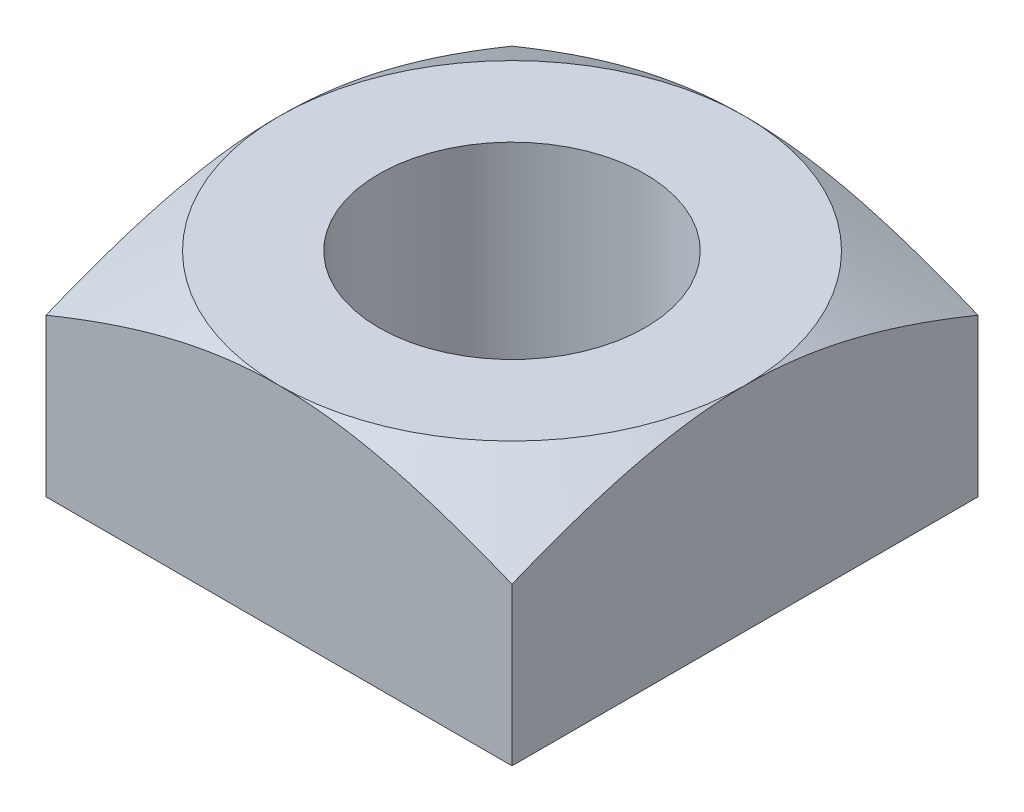
ISO-10303-21;
HEADER;
FILE_DESCRIPTION(('STEP AP214'),'2;1');
FILE_NAME('part.step','',(''),(''),'','','');
FILE_SCHEMA(('AUTOMOTIVE_DESIGN { 1 0 10303 214 1 1 1 1 }'));
ENDSEC;
DATA;
#1=APPLICATION_CONTEXT('core data for automotive mechanical design processes');
#2=APPLICATION_PROTOCOL_DEFINITION('international standard','automotive_design',2000,#1);
#3=PRODUCT_CONTEXT('',#1,'mechanical');
#4=PRODUCT('Part','Part','',(#3));
#5=PRODUCT_RELATED_PRODUCT_CATEGORY('part','',(#4));
#6=PRODUCT_DEFINITION_FORMATION('','',#4);
#7=PRODUCT_DEFINITION_CONTEXT('part definition',#1,'design');
#8=PRODUCT_DEFINITION('design','',#6,#7);
#9=PRODUCT_DEFINITION_SHAPE('','',#8);
#10=(LENGTH_UNIT() NAMED_UNIT(*) SI_UNIT(.MILLI.,.METRE.));
#11=(NAMED_UNIT(*) PLANE_ANGLE_UNIT() SI_UNIT($,.RADIAN.));
#12=(NAMED_UNIT(*) SI_UNIT($,.STERADIAN.) SOLID_ANGLE_UNIT());
#13=UNCERTAINTY_MEASURE_WITH_UNIT(LENGTH_MEASURE(1.E-05),#10,'distance_accuracy_value','');
#14=(GEOMETRIC_REPRESENTATION_CONTEXT(3) GLOBAL_UNCERTAINTY_ASSIGNED_CONTEXT((#13)) GLOBAL_UNIT_ASSIGNED_CONTEXT((#10,
#11,#12)) REPRESENTATION_CONTEXT('',''));
#15=CARTESIAN_POINT('',(0.,0.,0.));
#16=DIRECTION('',(0.,0.,1.));
#17=DIRECTION('',(1.,0.,0.));
#18=AXIS2_PLACEMENT_3D('',#15,#16,#17);
#19=CARTESIAN_POINT('',(-3.5,1.6,3.5));
#20=DIRECTION('',(0.,1.,0.));
#21=DIRECTION('',(0.,0.,1.));
#22=AXIS2_PLACEMENT_3D('',#19,#20,#21);
#23=PLANE('',#22);
#24=CARTESIAN_POINT('',(0.,1.6,0.));
#25=DIRECTION('',(0.,1.,0.));
#26=DIRECTION('',(0.,0.,1.));
#27=AXIS2_PLACEMENT_3D('',#24,#25,#26);
#28=CIRCLE('',#27,2.);
#29=CARTESIAN_POINT('',(0.,1.6,2.));
#30=VERTEX_POINT('',#29);
#31=EDGE_CURVE('E173',#30,#30,#28,.T.);
#32=ORIENTED_EDGE('',*,*,#31,.F.);
#33=EDGE_LOOP('',(#32));
#34=FACE_BOUND('',#33,.T.);
#35=CARTESIAN_POINT('',(0.,1.6,0.));
#36=DIRECTION('',(0.,1.,0.));
#37=DIRECTION('',(0.,0.,1.));
#38=AXIS2_PLACEMENT_3D('',#35,#36,#37);
#39=CIRCLE('',#38,3.5);
#40=CARTESIAN_POINT('',(-3.5,1.6,0.));
#41=VERTEX_POINT('',#40);
#42=CARTESIAN_POINT('',(0.,1.6,3.5));
#43=VERTEX_POINT('',#42);
#44=EDGE_CURVE('E93',#41,#43,#39,.T.);
#45=ORIENTED_EDGE('',*,*,#44,.T.);
#46=CARTESIAN_POINT('',(3.5,1.6,0.));
#47=VERTEX_POINT('',#46);
#48=EDGE_CURVE('E106',#43,#47,#39,.T.);
#49=ORIENTED_EDGE('',*,*,#48,.T.);
#50=CARTESIAN_POINT('',(0.,1.6,-3.5));
#51=VERTEX_POINT('',#50);
#52=EDGE_CURVE('E57',#47,#51,#39,.T.);
#53=ORIENTED_EDGE('',*,*,#52,.T.);
#54=EDGE_CURVE('E104',#51,#41,#39,.T.);
#55=ORIENTED_EDGE('',*,*,#54,.T.);
#56=EDGE_LOOP('',(#45,#49,#53,#55));
#57=FACE_BOUND('',#56,.T.);
#58=ADVANCED_FACE('F36',(#34,#57),#23,.T.);
#59=CARTESIAN_POINT('',(-3.5,1.6,-3.5));
#60=DIRECTION('',(1.,0.,0.));
#61=DIRECTION('',(0.,0.,-1.));
#62=AXIS2_PLACEMENT_3D('',#59,#60,#61);
#63=PLANE('',#62);
#64=CARTESIAN_POINT('',(-3.5,-0.906703040803493,-7.01732424699288));
#65=CARTESIAN_POINT('',(-3.5,-0.8183647613352,-6.84631622698577));
#66=CARTESIAN_POINT('',(-3.5,-0.730512916491286,-6.67505450470276));
#67=CARTESIAN_POINT('',(-3.5,-0.556041209022,-6.33189208262874));
#68=CARTESIAN_POINT('',(-3.5,-0.469421420892597,-6.15999134498584));
#69=CARTESIAN_POINT('',(-3.5,-0.297491875948904,-5.81505515095732));
#70=CARTESIAN_POINT('',(-3.5,-0.212185476740889,-5.64201801780608));
#71=CARTESIAN_POINT('',(-3.5,-0.0434526774197161,-5.29503264202384));
#72=CARTESIAN_POINT('',(-3.5,0.0399737639335897,-5.12108441948256));
#73=CARTESIAN_POINT('',(-3.5,0.209109294297862,-4.76221964059083));
#74=CARTESIAN_POINT('',(-3.5,0.294681338710658,-4.57723829022077));
#75=CARTESIAN_POINT('',(-3.5,0.462413702504157,-4.20573677559367));
#76=CARTESIAN_POINT('',(-3.5,0.544574143537961,-4.01921666649143));
#77=CARTESIAN_POINT('',(-3.5,0.704353209391373,-3.6444019804712));
#78=CARTESIAN_POINT('',(-3.5,0.781975327641687,-3.45610890149154));
#79=CARTESIAN_POINT('',(-3.5,0.931248658766028,-3.07718361251794));
#80=CARTESIAN_POINT('',(-3.5,1.00290078965972,-2.88655176735324));
#81=CARTESIAN_POINT('',(-3.5,1.13741463708561,-2.50462457800413));
#82=CARTESIAN_POINT('',(-3.5,1.20036741820168,-2.31336168839638));
#83=CARTESIAN_POINT('',(-3.5,1.31576373216677,-1.92762500361383));
#84=CARTESIAN_POINT('',(-3.5,1.36820690414002,-1.73315109842823));
#85=CARTESIAN_POINT('',(-3.5,1.45835420754646,-1.34480210612033));
#86=CARTESIAN_POINT('',(-3.5,1.4963295265121,-1.15099135591937));
#87=CARTESIAN_POINT('',(-3.5,1.55565623137818,-0.760782521838996));
#88=CARTESIAN_POINT('',(-3.5,1.5770118037869,-0.564385102225106));
#89=CARTESIAN_POINT('',(-3.5,1.59616502031207,-0.246948294962581));
#90=CARTESIAN_POINT('',(-3.5,1.59988919375486,-0.126247552739355));
#91=CARTESIAN_POINT('',(-3.5,1.60010574764745,0.115172230874657));
#92=CARTESIAN_POINT('',(-3.5,1.59659786152241,0.235891272775966));
#93=CARTESIAN_POINT('',(-3.5,1.58250174471944,0.476932765619612));
#94=CARTESIAN_POINT('',(-3.5,1.57191204418685,0.597255129018975));
#95=CARTESIAN_POINT('',(-3.5,1.54411252847875,0.837126797765718));
#96=CARTESIAN_POINT('',(-3.5,1.52690249772473,0.956676077810189));
#97=CARTESIAN_POINT('',(-3.5,1.4859550758422,1.19809541561606));
#98=CARTESIAN_POINT('',(-3.5,1.46204797257351,1.3199363827827));
#99=CARTESIAN_POINT('',(-3.5,1.40874870685464,1.56240307690696));
#100=CARTESIAN_POINT('',(-3.5,1.37935640476038,1.68302877284338));
#101=CARTESIAN_POINT('',(-3.5,1.31588360975929,1.92309478374023));
#102=CARTESIAN_POINT('',(-3.5,1.28180079124911,2.04253447897701));
#103=CARTESIAN_POINT('',(-3.5,1.20970137526423,2.2802038857662));
#104=CARTESIAN_POINT('',(-3.5,1.17168500010788,2.39843366528653));
#105=CARTESIAN_POINT('',(-3.5,1.05974894784066,2.73061150646999));
#106=CARTESIAN_POINT('',(-3.5,0.982024797617597,2.94327620117727));
#107=CARTESIAN_POINT('',(-3.5,0.818776624992246,3.36560898737656));
#108=CARTESIAN_POINT('',(-3.5,0.733250380874508,3.57527620552667));
#109=CARTESIAN_POINT('',(-3.5,0.556459358947118,3.99239871148477));
#110=CARTESIAN_POINT('',(-3.5,0.465189204028289,4.19985170747513));
#111=CARTESIAN_POINT('',(-3.5,0.278481793345864,4.6128362689507));
#112=CARTESIAN_POINT('',(-3.5,0.183044984761985,4.81836803776815));
#113=CARTESIAN_POINT('',(-3.5,-0.0112837723064443,5.22860059169862));
#114=CARTESIAN_POINT('',(-3.5,-0.11018589341064,5.43329654220325));
#115=CARTESIAN_POINT('',(-3.5,-0.310413456505948,5.84150222975475));
#116=CARTESIAN_POINT('',(-3.5,-0.411738951386549,6.04501194079146));
#117=CARTESIAN_POINT('',(-3.5,-0.616220948591182,6.45096796445593));
#118=CARTESIAN_POINT('',(-3.5,-0.719376417416901,6.65341479857179));
#119=CARTESIAN_POINT('',(-3.5,-0.927183676805307,7.057539609941));
#120=CARTESIAN_POINT('',(-3.5,-1.03183547737091,7.2592175820431));
#121=CARTESIAN_POINT('',(-3.5,-1.31919125754835,7.80899150831728));
#122=CARTESIAN_POINT('',(-3.5,-1.50308711571562,8.15646419743335));
#123=CARTESIAN_POINT('',(-3.5,-1.87342802987369,8.85011310423198));
#124=CARTESIAN_POINT('',(-3.5,-2.05987347217184,9.19628911509126));
#125=CARTESIAN_POINT('',(-3.5,-2.43336035598484,9.88533938025288));
#126=CARTESIAN_POINT('',(-3.5,-2.62038956534621,10.2282202724269));
#127=CARTESIAN_POINT('',(-3.5,-2.99581238655851,10.913155904429));
#128=CARTESIAN_POINT('',(-3.5,-3.18420575157043,11.2552107794879));
#129=CARTESIAN_POINT('',(-3.5,-3.37308705948272,11.5969936149847));
#130=B_SPLINE_CURVE_WITH_KNOTS('',3,(#64,#65,#66,#67,#68,#69,#70,#71,#72,#73,#74,#75,#76,#77,
#78,#79,#80,#81,#82,#83,#84,#85,#86,#87,#88,#89,#90,#91,#92,#93,#94,#95,#96,#97,#98,#99,#100,
#101,#102,#103,#104,#105,#106,#107,#108,#109,#110,#111,#112,#113,#114,#115,#116,#117,#118,#119,
#120,#121,#122,#123,#124,#125,#126,#127,#128,#129),.UNSPECIFIED.,.F.,.F.,(4,2,2,2,2,2,2,2,2,2,2,
2,2,2,2,2,2,2,2,2,2,2,2,2,2,2,2,2,2,2,2,2,4),(0.,0.577433421454476,1.15490161009769,
1.73365941964551,2.31240452074995,2.92382409304863,3.53522184420736,4.14614259423502,
4.75696922742461,5.3608182851893,5.96468807418869,6.5566053258911,7.1483734255422,
7.5104502116292,7.87254034416108,8.2347056530655,8.59688275619545,8.96922938441387,
9.34158549325482,9.714126889476,10.0866472417402,10.7656729214464,11.4448925669334,
12.1247577987082,12.8045502434981,13.4865403819187,14.1685454181999,14.850176828877,
15.5318127983628,16.7112004582328,17.8907688411403,19.0624840189079,20.2339922287411),.UNSPECIFIED.);
#131=CARTESIAN_POINT('',(-3.5,0.762987908916654,-3.5));
#132=VERTEX_POINT('',#131);
#133=EDGE_CURVE('E109',#132,#41,#130,.T.);
#134=ORIENTED_EDGE('',*,*,#133,.F.);
#135=DIRECTION('',(0.,-1.,0.));
#136=VECTOR('',#135,1.);
#137=CARTESIAN_POINT('',(-3.5,1.6,-3.5));
#138=LINE('',#137,#136);
#139=CARTESIAN_POINT('',(-3.5,-1.6,-3.5));
#140=VERTEX_POINT('',#139);
#141=EDGE_CURVE('E188',#132,#140,#138,.T.);
#142=ORIENTED_EDGE('',*,*,#141,.T.);
#143=DIRECTION('',(0.,0.,1.));
#144=VECTOR('',#143,1.);
#145=CARTESIAN_POINT('',(-3.5,-1.6,-3.5));
#146=LINE('',#145,#144);
#147=CARTESIAN_POINT('',(-3.5,-1.6,3.5));
#148=VERTEX_POINT('',#147);
#149=EDGE_CURVE('E169',#140,#148,#146,.T.);
#150=ORIENTED_EDGE('',*,*,#149,.T.);
#151=DIRECTION('',(0.,-1.,0.));
#152=VECTOR('',#151,1.);
#153=CARTESIAN_POINT('',(-3.5,1.6,3.5));
#154=LINE('',#153,#152);
#155=CARTESIAN_POINT('',(-3.5,0.762987908916654,3.5));
#156=VERTEX_POINT('',#155);
#157=EDGE_CURVE('E118',#156,#148,#154,.T.);
#158=ORIENTED_EDGE('',*,*,#157,.F.);
#159=EDGE_CURVE('E97',#41,#156,#130,.T.);
#160=ORIENTED_EDGE('',*,*,#159,.F.);
#161=EDGE_LOOP('',(#134,#142,#150,#158,#160));
#162=FACE_BOUND('',#161,.T.);
#163=ADVANCED_FACE('F38',(#162),#63,.F.);
#164=CARTESIAN_POINT('',(-3.5,1.6,3.5));
#165=DIRECTION('',(0.,0.,-1.));
#166=DIRECTION('',(-1.,0.,0.));
#167=AXIS2_PLACEMENT_3D('',#164,#165,#166);
#168=PLANE('',#167);
#169=CARTESIAN_POINT('',(-7.01732424699288,-0.906703040803492,3.5));
#170=CARTESIAN_POINT('',(-6.84631622698576,-0.818364761335199,3.5));
#171=CARTESIAN_POINT('',(-6.67505450470276,-0.730512916491285,3.5));
#172=CARTESIAN_POINT('',(-6.33189208262874,-0.556041209021999,3.5));
#173=CARTESIAN_POINT('',(-6.15999134498584,-0.469421420892595,3.5));
#174=CARTESIAN_POINT('',(-5.81505515095732,-0.297491875948902,3.5));
#175=CARTESIAN_POINT('',(-5.64201801780608,-0.212185476740888,3.5));
#176=CARTESIAN_POINT('',(-5.29503264202384,-0.0434526774197151,3.5));
#177=CARTESIAN_POINT('',(-5.12108441948255,0.039973763933591,3.5));
#178=CARTESIAN_POINT('',(-4.76221964059082,0.209109294297863,3.5));
#179=CARTESIAN_POINT('',(-4.57723829022077,0.294681338710659,3.5));
#180=CARTESIAN_POINT('',(-4.20573677559367,0.462413702504158,3.5));
#181=CARTESIAN_POINT('',(-4.01921666649143,0.544574143537962,3.5));
#182=CARTESIAN_POINT('',(-3.6444019804712,0.704353209391374,3.5));
#183=CARTESIAN_POINT('',(-3.45610890149154,0.781975327641688,3.5));
#184=CARTESIAN_POINT('',(-3.07718361251794,0.931248658766029,3.5));
#185=CARTESIAN_POINT('',(-2.88655176735324,1.00290078965972,3.5));
#186=CARTESIAN_POINT('',(-2.50462457800413,1.13741463708561,3.5));
#187=CARTESIAN_POINT('',(-2.31336168839638,1.20036741820168,3.5));
#188=CARTESIAN_POINT('',(-1.92762500361383,1.31576373216677,3.5));
#189=CARTESIAN_POINT('',(-1.73315109842823,1.36820690414003,3.5));
#190=CARTESIAN_POINT('',(-1.34480210612033,1.45835420754646,3.5));
#191=CARTESIAN_POINT('',(-1.15099135591937,1.4963295265121,3.5));
#192=CARTESIAN_POINT('',(-0.760782521838996,1.55565623137818,3.5));
#193=CARTESIAN_POINT('',(-0.564385102225105,1.5770118037869,3.5));
#194=CARTESIAN_POINT('',(-0.24694829496258,1.59616502031207,3.5));
#195=CARTESIAN_POINT('',(-0.126247552739354,1.59988919375486,3.5));
#196=CARTESIAN_POINT('',(0.115172230874657,1.60010574764745,3.5));
#197=CARTESIAN_POINT('',(0.235891272775967,1.59659786152241,3.5));
#198=CARTESIAN_POINT('',(0.476932765619614,1.58250174471944,3.5));
#199=CARTESIAN_POINT('',(0.597255129018977,1.57191204418685,3.5));
#200=CARTESIAN_POINT('',(0.837126797765719,1.54411252847875,3.5));
#201=CARTESIAN_POINT('',(0.95667607781019,1.52690249772473,3.5));
#202=CARTESIAN_POINT('',(1.19809541561606,1.4859550758422,3.5));
#203=CARTESIAN_POINT('',(1.3199363827827,1.46204797257351,3.5));
#204=CARTESIAN_POINT('',(1.56240307690696,1.40874870685464,3.5));
#205=CARTESIAN_POINT('',(1.68302877284338,1.37935640476038,3.5));
#206=CARTESIAN_POINT('',(1.92309478374023,1.31588360975929,3.5));
#207=CARTESIAN_POINT('',(2.04253447897701,1.28180079124911,3.5));
#208=CARTESIAN_POINT('',(2.2802038857662,1.20970137526423,3.5));
#209=CARTESIAN_POINT('',(2.39843366528653,1.17168500010788,3.5));
#210=CARTESIAN_POINT('',(2.73061150646999,1.05974894784066,3.5));
#211=CARTESIAN_POINT('',(2.94327620117727,0.982024797617597,3.5));
#212=CARTESIAN_POINT('',(3.36560898737656,0.818776624992246,3.5));
#213=CARTESIAN_POINT('',(3.57527620552667,0.733250380874508,3.5));
#214=CARTESIAN_POINT('',(3.99239871148477,0.556459358947118,3.5));
#215=CARTESIAN_POINT('',(4.19985170747513,0.465189204028289,3.5));
#216=CARTESIAN_POINT('',(4.6128362689507,0.278481793345864,3.5));
#217=CARTESIAN_POINT('',(4.81836803776815,0.183044984761985,3.5));
#218=CARTESIAN_POINT('',(5.22860059169862,-0.0112837723064446,3.5));
#219=CARTESIAN_POINT('',(5.43329654220325,-0.11018589341064,3.5));
#220=CARTESIAN_POINT('',(5.84150222975475,-0.310413456505948,3.5));
#221=CARTESIAN_POINT('',(6.04501194079146,-0.411738951386549,3.5));
#222=CARTESIAN_POINT('',(6.45096796445593,-0.616220948591183,3.5));
#223=CARTESIAN_POINT('',(6.6534147985718,-0.719376417416902,3.5));
#224=CARTESIAN_POINT('',(7.057539609941,-0.927183676805307,3.5));
#225=CARTESIAN_POINT('',(7.2592175820431,-1.03183547737091,3.5));
#226=CARTESIAN_POINT('',(7.80899150831728,-1.31919125754835,3.5));
#227=CARTESIAN_POINT('',(8.15646419743335,-1.50308711571562,3.5));
#228=CARTESIAN_POINT('',(8.85011310423198,-1.87342802987369,3.5));
#229=CARTESIAN_POINT('',(9.19628911509126,-2.05987347217184,3.5));
#230=CARTESIAN_POINT('',(9.88533938025288,-2.43336035598484,3.5));
#231=CARTESIAN_POINT('',(10.2282202724269,-2.62038956534621,3.5));
#232=CARTESIAN_POINT('',(10.913155904429,-2.99581238655851,3.5));
#233=CARTESIAN_POINT('',(11.2552107794879,-3.18420575157043,3.5));
#234=CARTESIAN_POINT('',(11.5969936149847,-3.37308705948272,3.5));
#235=B_SPLINE_CURVE_WITH_KNOTS('',3,(#169,#170,#171,#172,#173,#174,#175,#176,#177,#178,#179,
#180,#181,#182,#183,#184,#185,#186,#187,#188,#189,#190,#191,#192,#193,#194,#195,#196,#197,#198,
#199,#200,#201,#202,#203,#204,#205,#206,#207,#208,#209,#210,#211,#212,#213,#214,#215,#216,#217,
#218,#219,#220,#221,#222,#223,#224,#225,#226,#227,#228,#229,#230,#231,#232,#233,#234),
.UNSPECIFIED.,.F.,.F.,(4,2,2,2,2,2,2,2,2,2,2,2,2,2,2,2,2,2,2,2,2,2,2,2,2,2,2,2,2,2,2,2,4),(0.,
0.577433421454475,1.15490161009769,1.73365941964551,2.31240452074995,2.92382409304863,
3.53522184420736,4.14614259423502,4.75696922742461,5.3608182851893,5.96468807418868,
6.5566053258911,7.1483734255422,7.5104502116292,7.87254034416108,8.2347056530655,
8.59688275619545,8.96922938441388,9.34158549325482,9.714126889476,10.0866472417402,
10.7656729214464,11.4448925669334,12.1247577987082,12.8045502434981,13.4865403819187,
14.1685454181999,14.850176828877,15.5318127983628,16.7112004582328,17.8907688411403,
19.0624840189079,20.2339922287411),.UNSPECIFIED.);
#236=EDGE_CURVE('E99',#156,#43,#235,.T.);
#237=ORIENTED_EDGE('',*,*,#236,.F.);
#238=ORIENTED_EDGE('',*,*,#157,.T.);
#239=DIRECTION('',(1.,0.,0.));
#240=VECTOR('',#239,1.);
#241=CARTESIAN_POINT('',(-3.5,-1.6,3.5));
#242=LINE('',#241,#240);
#243=CARTESIAN_POINT('',(3.5,-1.6,3.5));
#244=VERTEX_POINT('',#243);
#245=EDGE_CURVE('E179',#148,#244,#242,.T.);
#246=ORIENTED_EDGE('',*,*,#245,.T.);
#247=DIRECTION('',(0.,-1.,0.));
#248=VECTOR('',#247,1.);
#249=CARTESIAN_POINT('',(3.5,1.6,3.5));
#250=LINE('',#249,#248);
#251=CARTESIAN_POINT('',(3.5,0.762987908916654,3.5));
#252=VERTEX_POINT('',#251);
#253=EDGE_CURVE('E192',#252,#244,#250,.T.);
#254=ORIENTED_EDGE('',*,*,#253,.F.);
#255=EDGE_CURVE('E128',#43,#252,#235,.T.);
#256=ORIENTED_EDGE('',*,*,#255,.F.);
#257=EDGE_LOOP('',(#237,#238,#246,#254,#256));
#258=FACE_BOUND('',#257,.T.);
#259=ADVANCED_FACE('F139',(#258),#168,.F.);
#260=CARTESIAN_POINT('',(3.5,1.6,-3.5));
#261=DIRECTION('',(-1.,0.,0.));
#262=DIRECTION('',(0.,0.,1.));
#263=AXIS2_PLACEMENT_3D('',#260,#261,#262);
#264=PLANE('',#263);
#265=CARTESIAN_POINT('',(3.5,-0.90670304046158,-7.01732424633109));
#266=CARTESIAN_POINT('',(3.5,-0.818364761006746,-6.84631622634682));
#267=CARTESIAN_POINT('',(3.5,-0.730512916176279,-6.67505450408667));
#268=CARTESIAN_POINT('',(3.5,-0.556041208733829,-6.33189208205841));
#269=CARTESIAN_POINT('',(3.5,-0.469421420617814,-6.15999134443841));
#270=CARTESIAN_POINT('',(3.5,-0.297491875700863,-5.81505515045585));
#271=CARTESIAN_POINT('',(3.5,-0.2121854765062,-5.64201801732766));
#272=CARTESIAN_POINT('',(3.5,-0.0434526772115803,-5.29503264159163));
#273=CARTESIAN_POINT('',(3.5,0.0399737641285235,-5.12108441907349));
#274=CARTESIAN_POINT('',(3.5,0.209109294464813,-4.7622196402318));
#275=CARTESIAN_POINT('',(3.5,0.294681338862874,-4.57723828988865));
#276=CARTESIAN_POINT('',(3.5,0.462413702627425,-4.20573677531563));
#277=CARTESIAN_POINT('',(3.5,0.544574143647017,-4.01921666624058));
#278=CARTESIAN_POINT('',(3.5,0.704353209472852,-3.64440198027509));
#279=CARTESIAN_POINT('',(3.5,0.7819753277098,-3.456108901323));
#280=CARTESIAN_POINT('',(3.5,0.93124865880876,-3.0771836124051));
#281=CARTESIAN_POINT('',(3.5,1.00290078969043,-2.88655176726855));
#282=CARTESIAN_POINT('',(3.5,1.13741463709171,-2.50462457798432));
#283=CARTESIAN_POINT('',(3.5,1.20036741819549,-2.31336168841342));
#284=CARTESIAN_POINT('',(3.5,1.31576373214033,-1.92762500370584));
#285=CARTESIAN_POINT('',(3.5,1.36820690410562,-1.73315109855837));
#286=CARTESIAN_POINT('',(3.5,1.45835420750271,-1.3448021063265));
#287=CARTESIAN_POINT('',(3.5,1.49632952646681,-1.15099135616341));
#288=CARTESIAN_POINT('',(3.5,1.55565623133764,-0.760782522159259));
#289=CARTESIAN_POINT('',(3.5,1.57701180375262,-0.564385102583711));
#290=CARTESIAN_POINT('',(3.5,1.5961650202971,-0.246948295339387));
#291=CARTESIAN_POINT('',(3.5,1.59988919374784,-0.12624755309614));
#292=CARTESIAN_POINT('',(3.5,1.60010574765386,0.115172230558327));
#293=CARTESIAN_POINT('',(3.5,1.59659786153433,0.235891272480069));
#294=CARTESIAN_POINT('',(3.5,1.58250174473974,0.476932765364736));
#295=CARTESIAN_POINT('',(3.5,1.57191204421003,0.597255128784686));
#296=CARTESIAN_POINT('',(3.5,1.54411252850511,0.837126797572521));
#297=CARTESIAN_POINT('',(3.5,1.5269024977514,0.956676077637498));
#298=CARTESIAN_POINT('',(3.5,1.48595507586711,1.19809541548505));
#299=CARTESIAN_POINT('',(3.5,1.46204797259625,1.31993638267284));
#300=CARTESIAN_POINT('',(3.5,1.40874870687098,1.56240307683903));
#301=CARTESIAN_POINT('',(3.5,1.37935640477248,1.68302877279622));
#302=CARTESIAN_POINT('',(3.5,1.31588360976124,1.92309478373425));
#303=CARTESIAN_POINT('',(3.5,1.28180079124515,2.04253447899145));
#304=CARTESIAN_POINT('',(3.5,1.20970137524716,2.28020388582108));
#305=CARTESIAN_POINT('',(3.5,1.17168500008362,2.39843366536142));
#306=CARTESIAN_POINT('',(3.5,1.0597489478085,2.73061150656007));
#307=CARTESIAN_POINT('',(3.5,0.982024797585694,2.9432762012628));
#308=CARTESIAN_POINT('',(3.5,0.818776624961467,3.3656089874532));
#309=CARTESIAN_POINT('',(3.5,0.733250380844603,3.57527620559895));
#310=CARTESIAN_POINT('',(3.5,0.556459358919384,3.99239871154847));
#311=CARTESIAN_POINT('',(3.5,0.465189204001854,4.19985170753461));
#312=CARTESIAN_POINT('',(3.5,0.278481793322293,4.61283626900183));
#313=CARTESIAN_POINT('',(3.5,0.18304498473998,4.81836803781518));
#314=CARTESIAN_POINT('',(3.5,-0.0112837723250333,5.22860059173728));
#315=CARTESIAN_POINT('',(3.5,-0.110185893427375,5.43329654223767));
#316=CARTESIAN_POINT('',(3.5,-0.310413456518847,5.84150222978074));
#317=CARTESIAN_POINT('',(3.5,-0.411738951397466,6.04501194081327));
#318=CARTESIAN_POINT('',(3.5,-0.616220948598055,6.45096796446944));
#319=CARTESIAN_POINT('',(3.5,-0.719376417421712,6.65341479858118));
#320=CARTESIAN_POINT('',(3.5,-0.92718367680593,7.05753960994218));
#321=CARTESIAN_POINT('',(3.5,-1.0318354773694,7.2592175820402));
#322=CARTESIAN_POINT('',(3.5,-1.31919125754091,7.8089915083031));
#323=CARTESIAN_POINT('',(3.5,-1.50308711570433,8.15646419741203));
#324=CARTESIAN_POINT('',(3.5,-1.87342802985459,8.85011310419639));
#325=CARTESIAN_POINT('',(3.5,-2.0598734721488,9.19628911504855));
#326=CARTESIAN_POINT('',(3.5,-2.43336035595414,9.88533938019644));
#327=CARTESIAN_POINT('',(3.5,-2.62038956531178,10.2282202723638));
#328=CARTESIAN_POINT('',(3.5,-2.9958123865166,10.9131559043528));
#329=CARTESIAN_POINT('',(3.5,-3.18420575152477,11.2552107794051));
#330=CARTESIAN_POINT('',(3.5,-3.3730870594333,11.5969936148953));
#331=B_SPLINE_CURVE_WITH_KNOTS('',3,(#265,#266,#267,#268,#269,#270,#271,#272,#273,#274,#275,
#276,#277,#278,#279,#280,#281,#282,#283,#284,#285,#286,#287,#288,#289,#290,#291,#292,#293,#294,
#295,#296,#297,#298,#299,#300,#301,#302,#303,#304,#305,#306,#307,#308,#309,#310,#311,#312,#313,
#314,#315,#316,#317,#318,#319,#320,#321,#322,#323,#324,#325,#326,#327,#328,#329,#330),
.UNSPECIFIED.,.F.,.F.,(4,2,2,2,2,2,2,2,2,2,2,2,2,2,2,2,2,2,2,2,2,2,2,2,2,2,2,2,2,2,2,2,4),(0.,
0.577433421375058,1.15490160993885,1.73365941940691,2.3124045204316,2.92382409263847,
3.53522184370539,4.14614259364134,4.75696922673926,5.36081828438755,5.96468807327055,
6.55660532486098,7.14837342440043,7.5104502105481,7.87254034314066,8.23470565210572,
8.59688275529633,8.96922938357821,9.34158549248263,9.71412688876754,10.0866472410955,
10.7656729207887,11.4448925662626,12.1247577980242,12.8045502428009,13.4865403812077,
14.168545417475,14.8501768281383,15.5318127976103,16.7112004574559,17.890768840339,
19.0624840180839,20.2339922278942),.UNSPECIFIED.);
#332=EDGE_CURVE('E127',#252,#47,#331,.F.);
#333=ORIENTED_EDGE('',*,*,#332,.F.);
#334=ORIENTED_EDGE('',*,*,#253,.T.);
#335=DIRECTION('',(0.,0.,-1.));
#336=VECTOR('',#335,1.);
#337=CARTESIAN_POINT('',(3.5,-1.6,-3.5));
#338=LINE('',#337,#336);
#339=CARTESIAN_POINT('',(3.5,-1.6,-3.5));
#340=VERTEX_POINT('',#339);
#341=EDGE_CURVE('E182',#244,#340,#338,.T.);
#342=ORIENTED_EDGE('',*,*,#341,.T.);
#343=DIRECTION('',(0.,-1.,0.));
#344=VECTOR('',#343,1.);
#345=CARTESIAN_POINT('',(3.5,1.6,-3.5));
#346=LINE('',#345,#344);
#347=CARTESIAN_POINT('',(3.5,0.762987908916654,-3.5));
#348=VERTEX_POINT('',#347);
#349=EDGE_CURVE('E190',#348,#340,#346,.T.);
#350=ORIENTED_EDGE('',*,*,#349,.F.);
#351=EDGE_CURVE('E120',#47,#348,#331,.F.);
#352=ORIENTED_EDGE('',*,*,#351,.F.);
#353=EDGE_LOOP('',(#333,#334,#342,#350,#352));
#354=FACE_BOUND('',#353,.T.);
#355=ADVANCED_FACE('F135',(#354),#264,.F.);
#356=CARTESIAN_POINT('',(-3.5,1.6,-3.5));
#357=DIRECTION('',(0.,0.,1.));
#358=DIRECTION('',(1.,0.,0.));
#359=AXIS2_PLACEMENT_3D('',#356,#357,#358);
#360=PLANE('',#359);
#361=CARTESIAN_POINT('',(-7.01732424633109,-0.906703040461582,-3.5));
#362=CARTESIAN_POINT('',(-6.84631622634683,-0.818364761006747,-3.5));
#363=CARTESIAN_POINT('',(-6.67505450408667,-0.730512916176279,-3.5));
#364=CARTESIAN_POINT('',(-6.33189208205841,-0.55604120873383,-3.5));
#365=CARTESIAN_POINT('',(-6.15999134443841,-0.469421420617816,-3.5));
#366=CARTESIAN_POINT('',(-5.81505515045585,-0.297491875700864,-3.5));
#367=CARTESIAN_POINT('',(-5.64201801732766,-0.212185476506201,-3.5));
#368=CARTESIAN_POINT('',(-5.29503264159163,-0.0434526772115806,-3.5));
#369=CARTESIAN_POINT('',(-5.12108441907349,0.0399737641285231,-3.5));
#370=CARTESIAN_POINT('',(-4.7622196402318,0.209109294464812,-3.5));
#371=CARTESIAN_POINT('',(-4.57723828988865,0.294681338862874,-3.5));
#372=CARTESIAN_POINT('',(-4.20573677531563,0.462413702627425,-3.5));
#373=CARTESIAN_POINT('',(-4.01921666624058,0.544574143647017,-3.5));
#374=CARTESIAN_POINT('',(-3.64440198027509,0.704353209472852,-3.5));
#375=CARTESIAN_POINT('',(-3.456108901323,0.7819753277098,-3.5));
#376=CARTESIAN_POINT('',(-3.0771836124051,0.93124865880876,-3.5));
#377=CARTESIAN_POINT('',(-2.88655176726855,1.00290078969043,-3.5));
#378=CARTESIAN_POINT('',(-2.50462457798432,1.13741463709171,-3.5));
#379=CARTESIAN_POINT('',(-2.31336168841342,1.20036741819549,-3.5));
#380=CARTESIAN_POINT('',(-1.92762500370583,1.31576373214033,-3.5));
#381=CARTESIAN_POINT('',(-1.73315109855836,1.36820690410562,-3.5));
#382=CARTESIAN_POINT('',(-1.3448021063265,1.45835420750271,-3.5));
#383=CARTESIAN_POINT('',(-1.15099135616341,1.49632952646681,-3.5));
#384=CARTESIAN_POINT('',(-0.760782522159259,1.55565623133764,-3.5));
#385=CARTESIAN_POINT('',(-0.56438510258371,1.57701180375262,-3.5));
#386=CARTESIAN_POINT('',(-0.246948295339387,1.5961650202971,-3.5));
#387=CARTESIAN_POINT('',(-0.126247553096139,1.59988919374783,-3.5));
#388=CARTESIAN_POINT('',(0.115172230558329,1.60010574765386,-3.5));
#389=CARTESIAN_POINT('',(0.235891272480071,1.59659786153433,-3.5));
#390=CARTESIAN_POINT('',(0.476932765364738,1.58250174473974,-3.5));
#391=CARTESIAN_POINT('',(0.597255128784688,1.57191204421003,-3.5));
#392=CARTESIAN_POINT('',(0.837126797572523,1.54411252850511,-3.5));
#393=CARTESIAN_POINT('',(0.9566760776375,1.5269024977514,-3.5));
#394=CARTESIAN_POINT('',(1.19809541548505,1.48595507586711,-3.5));
#395=CARTESIAN_POINT('',(1.31993638267285,1.46204797259625,-3.5));
#396=CARTESIAN_POINT('',(1.56240307683904,1.40874870687098,-3.5));
#397=CARTESIAN_POINT('',(1.68302877279622,1.37935640477248,-3.5));
#398=CARTESIAN_POINT('',(1.92309478373425,1.31588360976124,-3.5));
#399=CARTESIAN_POINT('',(2.04253447899145,1.28180079124515,-3.5));
#400=CARTESIAN_POINT('',(2.28020388582108,1.20970137524716,-3.5));
#401=CARTESIAN_POINT('',(2.39843366536142,1.17168500008362,-3.5));
#402=CARTESIAN_POINT('',(2.73061150656007,1.0597489478085,-3.5));
#403=CARTESIAN_POINT('',(2.9432762012628,0.982024797585693,-3.5));
#404=CARTESIAN_POINT('',(3.3656089874532,0.818776624961466,-3.5));
#405=CARTESIAN_POINT('',(3.57527620559896,0.733250380844603,-3.5));
#406=CARTESIAN_POINT('',(3.99239871154848,0.556459358919384,-3.5));
#407=CARTESIAN_POINT('',(4.19985170753461,0.465189204001853,-3.5));
#408=CARTESIAN_POINT('',(4.61283626900184,0.278481793322293,-3.5));
#409=CARTESIAN_POINT('',(4.81836803781518,0.18304498473998,-3.5));
#410=CARTESIAN_POINT('',(5.22860059173728,-0.0112837723250337,-3.5));
#411=CARTESIAN_POINT('',(5.43329654223768,-0.110185893427376,-3.5));
#412=CARTESIAN_POINT('',(5.84150222978074,-0.310413456518849,-3.5));
#413=CARTESIAN_POINT('',(6.04501194081328,-0.411738951397468,-3.5));
#414=CARTESIAN_POINT('',(6.45096796446944,-0.616220948598057,-3.5));
#415=CARTESIAN_POINT('',(6.65341479858118,-0.719376417421713,-3.5));
#416=CARTESIAN_POINT('',(7.05753960994218,-0.927183676805931,-3.5));
#417=CARTESIAN_POINT('',(7.2592175820402,-1.0318354773694,-3.5));
#418=CARTESIAN_POINT('',(7.8089915083031,-1.31919125754091,-3.5));
#419=CARTESIAN_POINT('',(8.15646419741203,-1.50308711570433,-3.5));
#420=CARTESIAN_POINT('',(8.85011310419639,-1.8734280298546,-3.5));
#421=CARTESIAN_POINT('',(9.19628911504855,-2.05987347214881,-3.5));
#422=CARTESIAN_POINT('',(9.88533938019645,-2.43336035595414,-3.5));
#423=CARTESIAN_POINT('',(10.2282202723638,-2.62038956531178,-3.5));
#424=CARTESIAN_POINT('',(10.9131559043528,-2.9958123865166,-3.5));
#425=CARTESIAN_POINT('',(11.2552107794051,-3.18420575152477,-3.5));
#426=CARTESIAN_POINT('',(11.5969936148953,-3.3730870594333,-3.5));
#427=B_SPLINE_CURVE_WITH_KNOTS('',3,(#361,#362,#363,#364,#365,#366,#367,#368,#369,#370,#371,
#372,#373,#374,#375,#376,#377,#378,#379,#380,#381,#382,#383,#384,#385,#386,#387,#388,#389,#390,
#391,#392,#393,#394,#395,#396,#397,#398,#399,#400,#401,#402,#403,#404,#405,#406,#407,#408,#409,
#410,#411,#412,#413,#414,#415,#416,#417,#418,#419,#420,#421,#422,#423,#424,#425,#426),
.UNSPECIFIED.,.F.,.F.,(4,2,2,2,2,2,2,2,2,2,2,2,2,2,2,2,2,2,2,2,2,2,2,2,2,2,2,2,2,2,2,2,4),(0.,
0.577433421375058,1.15490160993885,1.73365941940691,2.3124045204316,2.92382409263847,
3.53522184370539,4.14614259364135,4.75696922673926,5.36081828438756,5.96468807327055,
6.55660532486098,7.14837342440043,7.5104502105481,7.87254034314066,8.23470565210573,
8.59688275529633,8.96922938357821,9.34158549248263,9.71412688876754,10.0866472410955,
10.7656729207887,11.4448925662626,12.1247577980242,12.8045502428009,13.4865403812077,
14.168545417475,14.8501768281383,15.5318127976103,16.7112004574559,17.890768840339,
19.0624840180839,20.2339922278943),.UNSPECIFIED.);
#428=EDGE_CURVE('E12',#348,#51,#427,.F.);
#429=ORIENTED_EDGE('',*,*,#428,.F.);
#430=ORIENTED_EDGE('',*,*,#349,.T.);
#431=DIRECTION('',(-1.,0.,0.));
#432=VECTOR('',#431,1.);
#433=CARTESIAN_POINT('',(-3.5,-1.6,-3.5));
#434=LINE('',#433,#432);
#435=EDGE_CURVE('E185',#340,#140,#434,.T.);
#436=ORIENTED_EDGE('',*,*,#435,.T.);
#437=ORIENTED_EDGE('',*,*,#141,.F.);
#438=EDGE_CURVE('E41',#51,#132,#427,.F.);
#439=ORIENTED_EDGE('',*,*,#438,.F.);
#440=EDGE_LOOP('',(#429,#430,#436,#437,#439));
#441=FACE_BOUND('',#440,.T.);
#442=ADVANCED_FACE('F138',(#441),#360,.F.);
#443=CARTESIAN_POINT('',(-3.5,-1.6,3.5));
#444=DIRECTION('',(0.,1.,0.));
#445=DIRECTION('',(0.,0.,1.));
#446=AXIS2_PLACEMENT_3D('',#443,#444,#445);
#447=PLANE('',#446);
#448=ORIENTED_EDGE('',*,*,#149,.F.);
#449=ORIENTED_EDGE('',*,*,#435,.F.);
#450=ORIENTED_EDGE('',*,*,#341,.F.);
#451=ORIENTED_EDGE('',*,*,#245,.F.);
#452=EDGE_LOOP('',(#448,#449,#450,#451));
#453=FACE_BOUND('',#452,.T.);
#454=CARTESIAN_POINT('',(0.,-1.6,0.));
#455=DIRECTION('',(0.,1.,0.));
#456=DIRECTION('',(0.,0.,1.));
#457=AXIS2_PLACEMENT_3D('',#454,#455,#456);
#458=CIRCLE('',#457,2.);
#459=CARTESIAN_POINT('',(0.,-1.6,2.));
#460=VERTEX_POINT('',#459);
#461=EDGE_CURVE('E114',#460,#460,#458,.T.);
#462=ORIENTED_EDGE('',*,*,#461,.T.);
#463=EDGE_LOOP('',(#462));
#464=FACE_BOUND('',#463,.T.);
#465=ADVANCED_FACE('F157',(#453,#464),#447,.F.);
#466=CARTESIAN_POINT('',(0.,1.6,0.));
#467=DIRECTION('',(0.,-1.,0.));
#468=DIRECTION('',(0.,0.,-1.));
#469=AXIS2_PLACEMENT_3D('',#466,#467,#468);
#470=CYLINDRICAL_SURFACE('',#469,2.);
#471=ORIENTED_EDGE('',*,*,#31,.T.);
#472=EDGE_LOOP('',(#471));
#473=FACE_BOUND('',#472,.T.);
#474=ORIENTED_EDGE('',*,*,#461,.F.);
#475=EDGE_LOOP('',(#474));
#476=FACE_BOUND('',#475,.T.);
#477=ADVANCED_FACE('F156',(#473,#476),#470,.F.);
#478=CARTESIAN_POINT('',(0.,1.6,0.));
#479=DIRECTION('',(0.,-1.,0.));
#480=DIRECTION('',(0.,0.,1.));
#481=AXIS2_PLACEMENT_3D('',#478,#479,#480);
#482=CONICAL_SURFACE('',#481,3.5,1.0471975511966);
#483=ORIENTED_EDGE('',*,*,#133,.T.);
#484=ORIENTED_EDGE('',*,*,#54,.F.);
#485=ORIENTED_EDGE('',*,*,#438,.T.);
#486=EDGE_LOOP('',(#483,#484,#485));
#487=FACE_BOUND('',#486,.T.);
#488=ADVANCED_FACE('F110',(#487),#482,.T.);
#489=ORIENTED_EDGE('',*,*,#351,.T.);
#490=ORIENTED_EDGE('',*,*,#428,.T.);
#491=ORIENTED_EDGE('',*,*,#52,.F.);
#492=EDGE_LOOP('',(#489,#490,#491));
#493=FACE_BOUND('',#492,.T.);
#494=ADVANCED_FACE('F200',(#493),#482,.T.);
#495=ORIENTED_EDGE('',*,*,#255,.T.);
#496=ORIENTED_EDGE('',*,*,#332,.T.);
#497=ORIENTED_EDGE('',*,*,#48,.F.);
#498=EDGE_LOOP('',(#495,#496,#497));
#499=FACE_BOUND('',#498,.T.);
#500=ADVANCED_FACE('F199',(#499),#482,.T.);
#501=ORIENTED_EDGE('',*,*,#159,.T.);
#502=ORIENTED_EDGE('',*,*,#236,.T.);
#503=ORIENTED_EDGE('',*,*,#44,.F.);
#504=EDGE_LOOP('',(#501,#502,#503));
#505=FACE_BOUND('',#504,.T.);
#506=ADVANCED_FACE('F95',(#505),#482,.T.);
#507=CLOSED_SHELL('',(#58,#163,#259,#355,#442,#465,#477,#488,#494,#500,#506));
#508=MANIFOLD_SOLID_BREP('B2',#507);
#509=ADVANCED_BREP_SHAPE_REPRESENTATION('',(#18,#508),#14);
#510=SHAPE_DEFINITION_REPRESENTATION(#9,#509);
ENDSEC;
END-ISO-10303-21;
